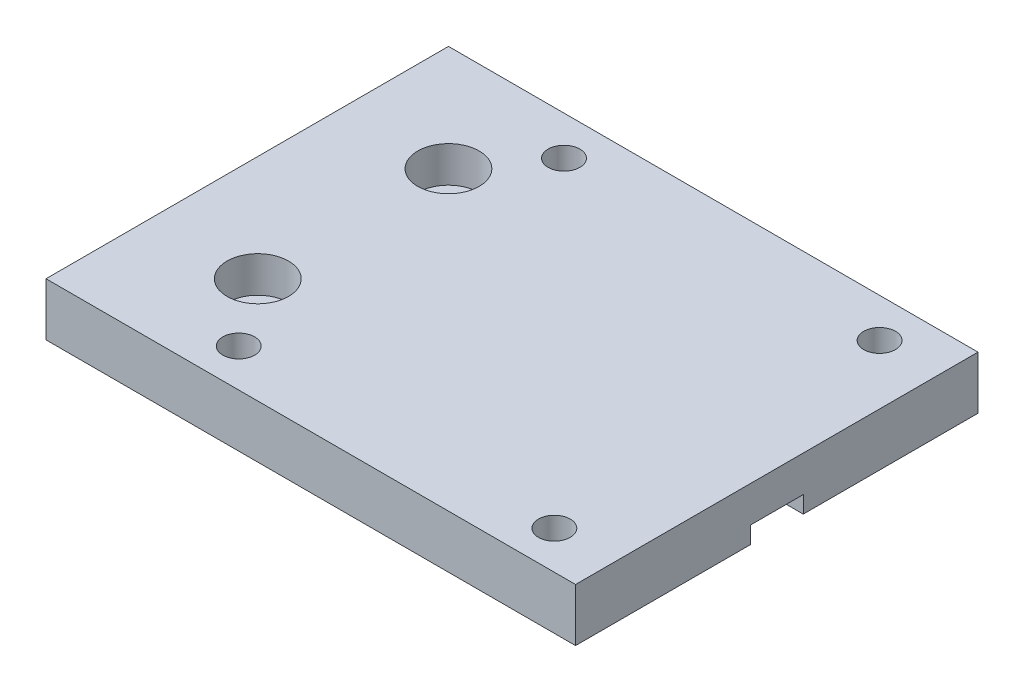
ISO-10303-21;
HEADER;
FILE_DESCRIPTION(('STEP AP214'),'2;1');
FILE_NAME('part.step','',(''),(''),'','','');
FILE_SCHEMA(('AUTOMOTIVE_DESIGN { 1 0 10303 214 1 1 1 1 }'));
ENDSEC;
DATA;
#1=APPLICATION_CONTEXT('core data for automotive mechanical design processes');
#2=APPLICATION_PROTOCOL_DEFINITION('international standard','automotive_design',2000,#1);
#3=PRODUCT_CONTEXT('',#1,'mechanical');
#4=PRODUCT('Part','Part','',(#3));
#5=PRODUCT_RELATED_PRODUCT_CATEGORY('part','',(#4));
#6=PRODUCT_DEFINITION_FORMATION('','',#4);
#7=PRODUCT_DEFINITION_CONTEXT('part definition',#1,'design');
#8=PRODUCT_DEFINITION('design','',#6,#7);
#9=PRODUCT_DEFINITION_SHAPE('','',#8);
#10=(LENGTH_UNIT() NAMED_UNIT(*) SI_UNIT(.MILLI.,.METRE.));
#11=(NAMED_UNIT(*) PLANE_ANGLE_UNIT() SI_UNIT($,.RADIAN.));
#12=(NAMED_UNIT(*) SI_UNIT($,.STERADIAN.) SOLID_ANGLE_UNIT());
#13=UNCERTAINTY_MEASURE_WITH_UNIT(LENGTH_MEASURE(1.E-05),#10,'distance_accuracy_value','');
#14=(GEOMETRIC_REPRESENTATION_CONTEXT(3) GLOBAL_UNCERTAINTY_ASSIGNED_CONTEXT((#13)) GLOBAL_UNIT_ASSIGNED_CONTEXT((#10,
#11,#12)) REPRESENTATION_CONTEXT('',''));
#15=CARTESIAN_POINT('',(0.,0.,0.));
#16=DIRECTION('',(0.,0.,1.));
#17=DIRECTION('',(1.,0.,0.));
#18=AXIS2_PLACEMENT_3D('',#15,#16,#17);
#19=CARTESIAN_POINT('',(31.75,-6.35,-24.13));
#20=DIRECTION('',(1.,0.,0.));
#21=DIRECTION('',(0.,0.,-1.));
#22=AXIS2_PLACEMENT_3D('',#19,#20,#21);
#23=PLANE('',#22);
#24=DIRECTION('',(0.,-1.,0.));
#25=VECTOR('',#24,1.);
#26=CARTESIAN_POINT('',(31.75,-4.318,-3.175));
#27=LINE('',#26,#25);
#28=CARTESIAN_POINT('',(31.75,-4.318,-3.175));
#29=VERTEX_POINT('',#28);
#30=CARTESIAN_POINT('',(31.75,-6.35,-3.175));
#31=VERTEX_POINT('',#30);
#32=EDGE_CURVE('E133',#29,#31,#27,.T.);
#33=ORIENTED_EDGE('',*,*,#32,.T.);
#34=DIRECTION('',(0.,0.,-1.));
#35=VECTOR('',#34,1.);
#36=CARTESIAN_POINT('',(31.75,-6.35,-24.13));
#37=LINE('',#36,#35);
#38=CARTESIAN_POINT('',(31.75,-6.35,-24.13));
#39=VERTEX_POINT('',#38);
#40=EDGE_CURVE('E82',#31,#39,#37,.T.);
#41=ORIENTED_EDGE('',*,*,#40,.T.);
#42=DIRECTION('',(0.,1.,0.));
#43=VECTOR('',#42,1.);
#44=CARTESIAN_POINT('',(31.75,-6.35,-24.13));
#45=LINE('',#44,#43);
#46=CARTESIAN_POINT('',(31.75,0.,-24.13));
#47=VERTEX_POINT('',#46);
#48=EDGE_CURVE('E37',#39,#47,#45,.T.);
#49=ORIENTED_EDGE('',*,*,#48,.T.);
#50=DIRECTION('',(0.,0.,-1.));
#51=VECTOR('',#50,1.);
#52=CARTESIAN_POINT('',(31.75,0.,-24.13));
#53=LINE('',#52,#51);
#54=CARTESIAN_POINT('',(31.75,0.,24.13));
#55=VERTEX_POINT('',#54);
#56=EDGE_CURVE('E140',#55,#47,#53,.T.);
#57=ORIENTED_EDGE('',*,*,#56,.F.);
#58=DIRECTION('',(0.,1.,0.));
#59=VECTOR('',#58,1.);
#60=CARTESIAN_POINT('',(31.75,-6.35,24.13));
#61=LINE('',#60,#59);
#62=CARTESIAN_POINT('',(31.75,-6.35,24.13));
#63=VERTEX_POINT('',#62);
#64=EDGE_CURVE('E11',#63,#55,#61,.T.);
#65=ORIENTED_EDGE('',*,*,#64,.F.);
#66=CARTESIAN_POINT('',(31.75,-6.35,3.17499999999999));
#67=VERTEX_POINT('',#66);
#68=EDGE_CURVE('E122',#63,#67,#37,.T.);
#69=ORIENTED_EDGE('',*,*,#68,.T.);
#70=DIRECTION('',(0.,-1.,0.));
#71=VECTOR('',#70,1.);
#72=CARTESIAN_POINT('',(31.75,-4.318,3.175));
#73=LINE('',#72,#71);
#74=CARTESIAN_POINT('',(31.75,-4.318,3.175));
#75=VERTEX_POINT('',#74);
#76=EDGE_CURVE('E50',#75,#67,#73,.T.);
#77=ORIENTED_EDGE('',*,*,#76,.F.);
#78=DIRECTION('',(0.,0.,1.));
#79=VECTOR('',#78,1.);
#80=CARTESIAN_POINT('',(31.75,-4.318,-3.175));
#81=LINE('',#80,#79);
#82=EDGE_CURVE('E113',#29,#75,#81,.T.);
#83=ORIENTED_EDGE('',*,*,#82,.F.);
#84=EDGE_LOOP('',(#33,#41,#49,#57,#65,#69,#77,#83));
#85=FACE_BOUND('',#84,.T.);
#86=ADVANCED_FACE('F34',(#85),#23,.T.);
#87=CARTESIAN_POINT('',(-31.75,-6.35,24.13));
#88=DIRECTION('',(0.,0.,1.));
#89=DIRECTION('',(1.,0.,0.));
#90=AXIS2_PLACEMENT_3D('',#87,#88,#89);
#91=PLANE('',#90);
#92=DIRECTION('',(1.,0.,0.));
#93=VECTOR('',#92,1.);
#94=CARTESIAN_POINT('',(-31.75,0.,24.13));
#95=LINE('',#94,#93);
#96=CARTESIAN_POINT('',(-31.75,0.,24.13));
#97=VERTEX_POINT('',#96);
#98=EDGE_CURVE('E160',#97,#55,#95,.T.);
#99=ORIENTED_EDGE('',*,*,#98,.F.);
#100=DIRECTION('',(0.,1.,0.));
#101=VECTOR('',#100,1.);
#102=CARTESIAN_POINT('',(-31.75,-6.35,24.13));
#103=LINE('',#102,#101);
#104=CARTESIAN_POINT('',(-31.75,-6.35,24.13));
#105=VERTEX_POINT('',#104);
#106=EDGE_CURVE('E42',#105,#97,#103,.T.);
#107=ORIENTED_EDGE('',*,*,#106,.F.);
#108=DIRECTION('',(1.,0.,0.));
#109=VECTOR('',#108,1.);
#110=CARTESIAN_POINT('',(-31.75,-6.35,24.13));
#111=LINE('',#110,#109);
#112=EDGE_CURVE('E150',#105,#63,#111,.T.);
#113=ORIENTED_EDGE('',*,*,#112,.T.);
#114=ORIENTED_EDGE('',*,*,#64,.T.);
#115=EDGE_LOOP('',(#99,#107,#113,#114));
#116=FACE_BOUND('',#115,.T.);
#117=ADVANCED_FACE('F171',(#116),#91,.T.);
#118=CARTESIAN_POINT('',(-31.75,-6.35,-24.13));
#119=DIRECTION('',(-1.,0.,0.));
#120=DIRECTION('',(0.,0.,1.));
#121=AXIS2_PLACEMENT_3D('',#118,#119,#120);
#122=PLANE('',#121);
#123=DIRECTION('',(0.,0.,1.));
#124=VECTOR('',#123,1.);
#125=CARTESIAN_POINT('',(-31.75,0.,-24.13));
#126=LINE('',#125,#124);
#127=CARTESIAN_POINT('',(-31.75,0.,-24.13));
#128=VERTEX_POINT('',#127);
#129=EDGE_CURVE('E157',#128,#97,#126,.T.);
#130=ORIENTED_EDGE('',*,*,#129,.F.);
#131=DIRECTION('',(0.,1.,0.));
#132=VECTOR('',#131,1.);
#133=CARTESIAN_POINT('',(-31.75,-6.35,-24.13));
#134=LINE('',#133,#132);
#135=CARTESIAN_POINT('',(-31.75,-6.35,-24.13));
#136=VERTEX_POINT('',#135);
#137=EDGE_CURVE('E163',#136,#128,#134,.T.);
#138=ORIENTED_EDGE('',*,*,#137,.F.);
#139=DIRECTION('',(0.,0.,1.));
#140=VECTOR('',#139,1.);
#141=CARTESIAN_POINT('',(-31.75,-6.35,-24.13));
#142=LINE('',#141,#140);
#143=EDGE_CURVE('E147',#136,#105,#142,.T.);
#144=ORIENTED_EDGE('',*,*,#143,.T.);
#145=ORIENTED_EDGE('',*,*,#106,.T.);
#146=EDGE_LOOP('',(#130,#138,#144,#145));
#147=FACE_BOUND('',#146,.T.);
#148=ADVANCED_FACE('F175',(#147),#122,.T.);
#149=CARTESIAN_POINT('',(-31.75,-6.35,-24.13));
#150=DIRECTION('',(0.,0.,-1.));
#151=DIRECTION('',(-1.,0.,0.));
#152=AXIS2_PLACEMENT_3D('',#149,#150,#151);
#153=PLANE('',#152);
#154=DIRECTION('',(-1.,0.,0.));
#155=VECTOR('',#154,1.);
#156=CARTESIAN_POINT('',(-31.75,0.,-24.13));
#157=LINE('',#156,#155);
#158=EDGE_CURVE('E154',#47,#128,#157,.T.);
#159=ORIENTED_EDGE('',*,*,#158,.F.);
#160=ORIENTED_EDGE('',*,*,#48,.F.);
#161=DIRECTION('',(-1.,0.,0.));
#162=VECTOR('',#161,1.);
#163=CARTESIAN_POINT('',(-31.75,-6.35,-24.13));
#164=LINE('',#163,#162);
#165=EDGE_CURVE('E144',#39,#136,#164,.T.);
#166=ORIENTED_EDGE('',*,*,#165,.T.);
#167=ORIENTED_EDGE('',*,*,#137,.T.);
#168=EDGE_LOOP('',(#159,#160,#166,#167));
#169=FACE_BOUND('',#168,.T.);
#170=ADVANCED_FACE('F168',(#169),#153,.T.);
#171=CARTESIAN_POINT('',(0.,-6.35,0.));
#172=DIRECTION('',(0.,1.,0.));
#173=DIRECTION('',(0.,0.,1.));
#174=AXIS2_PLACEMENT_3D('',#171,#172,#173);
#175=PLANE('',#174);
#176=CARTESIAN_POINT('',(-19.05,-6.35,11.43));
#177=DIRECTION('',(0.,1.,0.));
#178=DIRECTION('',(0.,0.,1.));
#179=AXIS2_PLACEMENT_3D('',#176,#177,#178);
#180=CIRCLE('',#179,2.159);
#181=CARTESIAN_POINT('',(-19.05,-6.35,13.589));
#182=VERTEX_POINT('',#181);
#183=EDGE_CURVE('E221',#182,#182,#180,.F.);
#184=ORIENTED_EDGE('',*,*,#183,.F.);
#185=EDGE_LOOP('',(#184));
#186=FACE_BOUND('',#185,.T.);
#187=CARTESIAN_POINT('',(24.638,-6.35,-19.442));
#188=DIRECTION('',(0.,1.,0.));
#189=DIRECTION('',(0.,0.,1.));
#190=AXIS2_PLACEMENT_3D('',#187,#188,#189);
#191=CIRCLE('',#190,1.905);
#192=CARTESIAN_POINT('',(24.638,-6.35,-17.537));
#193=VERTEX_POINT('',#192);
#194=EDGE_CURVE('E211',#193,#193,#191,.T.);
#195=ORIENTED_EDGE('',*,*,#194,.T.);
#196=EDGE_LOOP('',(#195));
#197=FACE_BOUND('',#196,.T.);
#198=CARTESIAN_POINT('',(24.638,-6.35,19.558));
#199=DIRECTION('',(0.,1.,0.));
#200=DIRECTION('',(0.,0.,1.));
#201=AXIS2_PLACEMENT_3D('',#198,#199,#200);
#202=CIRCLE('',#201,1.905);
#203=CARTESIAN_POINT('',(24.638,-6.35,21.463));
#204=VERTEX_POINT('',#203);
#205=EDGE_CURVE('E205',#204,#204,#202,.T.);
#206=ORIENTED_EDGE('',*,*,#205,.T.);
#207=EDGE_LOOP('',(#206));
#208=FACE_BOUND('',#207,.T.);
#209=CARTESIAN_POINT('',(-13.208,-6.35,-19.442));
#210=DIRECTION('',(0.,1.,0.));
#211=DIRECTION('',(0.,0.,1.));
#212=AXIS2_PLACEMENT_3D('',#209,#210,#211);
#213=CIRCLE('',#212,1.905);
#214=CARTESIAN_POINT('',(-13.208,-6.35,-17.537));
#215=VERTEX_POINT('',#214);
#216=EDGE_CURVE('E199',#215,#215,#213,.T.);
#217=ORIENTED_EDGE('',*,*,#216,.T.);
#218=EDGE_LOOP('',(#217));
#219=FACE_BOUND('',#218,.T.);
#220=CARTESIAN_POINT('',(-13.208,-6.35,19.558));
#221=DIRECTION('',(0.,1.,0.));
#222=DIRECTION('',(0.,0.,1.));
#223=AXIS2_PLACEMENT_3D('',#220,#221,#222);
#224=CIRCLE('',#223,1.905);
#225=CARTESIAN_POINT('',(-13.208,-6.35,21.463));
#226=VERTEX_POINT('',#225);
#227=EDGE_CURVE('E183',#226,#226,#224,.T.);
#228=ORIENTED_EDGE('',*,*,#227,.T.);
#229=EDGE_LOOP('',(#228));
#230=FACE_BOUND('',#229,.T.);
#231=CARTESIAN_POINT('',(-19.05,-6.35,-11.43));
#232=DIRECTION('',(0.,1.,0.));
#233=DIRECTION('',(0.,0.,1.));
#234=AXIS2_PLACEMENT_3D('',#231,#232,#233);
#235=CIRCLE('',#234,2.159);
#236=CARTESIAN_POINT('',(-19.05,-6.35,-9.271));
#237=VERTEX_POINT('',#236);
#238=EDGE_CURVE('E132',#237,#237,#235,.T.);
#239=ORIENTED_EDGE('',*,*,#238,.T.);
#240=EDGE_LOOP('',(#239));
#241=FACE_BOUND('',#240,.T.);
#242=ORIENTED_EDGE('',*,*,#40,.F.);
#243=DIRECTION('',(1.,0.,0.));
#244=VECTOR('',#243,1.);
#245=CARTESIAN_POINT('',(-15.24,-6.35,-3.175));
#246=LINE('',#245,#244);
#247=CARTESIAN_POINT('',(-15.24,-6.35,-3.175));
#248=VERTEX_POINT('',#247);
#249=EDGE_CURVE('E120',#248,#31,#246,.T.);
#250=ORIENTED_EDGE('',*,*,#249,.F.);
#251=DIRECTION('',(0.,0.,-1.));
#252=VECTOR('',#251,1.);
#253=CARTESIAN_POINT('',(-15.24,-6.35,-3.175));
#254=LINE('',#253,#252);
#255=CARTESIAN_POINT('',(-15.24,-6.35,3.175));
#256=VERTEX_POINT('',#255);
#257=EDGE_CURVE('E182',#256,#248,#254,.T.);
#258=ORIENTED_EDGE('',*,*,#257,.F.);
#259=DIRECTION('',(-1.,0.,0.));
#260=VECTOR('',#259,1.);
#261=CARTESIAN_POINT('',(-15.24,-6.35,3.175));
#262=LINE('',#261,#260);
#263=EDGE_CURVE('E179',#67,#256,#262,.T.);
#264=ORIENTED_EDGE('',*,*,#263,.F.);
#265=ORIENTED_EDGE('',*,*,#68,.F.);
#266=ORIENTED_EDGE('',*,*,#112,.F.);
#267=ORIENTED_EDGE('',*,*,#143,.F.);
#268=ORIENTED_EDGE('',*,*,#165,.F.);
#269=EDGE_LOOP('',(#242,#250,#258,#264,#265,#266,#267,#268));
#270=FACE_BOUND('',#269,.T.);
#271=ADVANCED_FACE('F177',(#186,#197,#208,#219,#230,#241,#270),#175,.F.);
#272=CARTESIAN_POINT('',(0.,0.,0.));
#273=DIRECTION('',(0.,1.,0.));
#274=DIRECTION('',(0.,0.,1.));
#275=AXIS2_PLACEMENT_3D('',#272,#273,#274);
#276=PLANE('',#275);
#277=CARTESIAN_POINT('',(-19.05,0.,11.43));
#278=DIRECTION('',(0.,-1.,0.));
#279=DIRECTION('',(0.,0.,-1.));
#280=AXIS2_PLACEMENT_3D('',#277,#278,#279);
#281=CIRCLE('',#280,3.683);
#282=CARTESIAN_POINT('',(-19.05,0.,7.747));
#283=VERTEX_POINT('',#282);
#284=EDGE_CURVE('E218',#283,#283,#281,.T.);
#285=ORIENTED_EDGE('',*,*,#284,.T.);
#286=EDGE_LOOP('',(#285));
#287=FACE_BOUND('',#286,.T.);
#288=CARTESIAN_POINT('',(24.638,0.,-19.442));
#289=DIRECTION('',(0.,1.,0.));
#290=DIRECTION('',(0.,0.,1.));
#291=AXIS2_PLACEMENT_3D('',#288,#289,#290);
#292=CIRCLE('',#291,1.905);
#293=CARTESIAN_POINT('',(24.638,0.,-17.537));
#294=VERTEX_POINT('',#293);
#295=EDGE_CURVE('E214',#294,#294,#292,.T.);
#296=ORIENTED_EDGE('',*,*,#295,.F.);
#297=EDGE_LOOP('',(#296));
#298=FACE_BOUND('',#297,.T.);
#299=CARTESIAN_POINT('',(24.638,0.,19.558));
#300=DIRECTION('',(0.,1.,0.));
#301=DIRECTION('',(0.,0.,1.));
#302=AXIS2_PLACEMENT_3D('',#299,#300,#301);
#303=CIRCLE('',#302,1.905);
#304=CARTESIAN_POINT('',(24.638,0.,21.463));
#305=VERTEX_POINT('',#304);
#306=EDGE_CURVE('E208',#305,#305,#303,.T.);
#307=ORIENTED_EDGE('',*,*,#306,.F.);
#308=EDGE_LOOP('',(#307));
#309=FACE_BOUND('',#308,.T.);
#310=CARTESIAN_POINT('',(-13.208,0.,-19.442));
#311=DIRECTION('',(0.,1.,0.));
#312=DIRECTION('',(0.,0.,1.));
#313=AXIS2_PLACEMENT_3D('',#310,#311,#312);
#314=CIRCLE('',#313,1.905);
#315=CARTESIAN_POINT('',(-13.208,0.,-17.537));
#316=VERTEX_POINT('',#315);
#317=EDGE_CURVE('E202',#316,#316,#314,.T.);
#318=ORIENTED_EDGE('',*,*,#317,.F.);
#319=EDGE_LOOP('',(#318));
#320=FACE_BOUND('',#319,.T.);
#321=CARTESIAN_POINT('',(-13.208,0.,19.558));
#322=DIRECTION('',(0.,1.,0.));
#323=DIRECTION('',(0.,0.,1.));
#324=AXIS2_PLACEMENT_3D('',#321,#322,#323);
#325=CIRCLE('',#324,1.905);
#326=CARTESIAN_POINT('',(-13.208,0.,21.463));
#327=VERTEX_POINT('',#326);
#328=EDGE_CURVE('E187',#327,#327,#325,.T.);
#329=ORIENTED_EDGE('',*,*,#328,.F.);
#330=EDGE_LOOP('',(#329));
#331=FACE_BOUND('',#330,.T.);
#332=CARTESIAN_POINT('',(-19.05,0.,-11.43));
#333=DIRECTION('',(0.,1.,0.));
#334=DIRECTION('',(0.,0.,1.));
#335=AXIS2_PLACEMENT_3D('',#332,#333,#334);
#336=CIRCLE('',#335,3.683);
#337=CARTESIAN_POINT('',(-19.05,0.,-7.747));
#338=VERTEX_POINT('',#337);
#339=EDGE_CURVE('E136',#338,#338,#336,.T.);
#340=ORIENTED_EDGE('',*,*,#339,.F.);
#341=EDGE_LOOP('',(#340));
#342=FACE_BOUND('',#341,.T.);
#343=ORIENTED_EDGE('',*,*,#56,.T.);
#344=ORIENTED_EDGE('',*,*,#158,.T.);
#345=ORIENTED_EDGE('',*,*,#129,.T.);
#346=ORIENTED_EDGE('',*,*,#98,.T.);
#347=EDGE_LOOP('',(#343,#344,#345,#346));
#348=FACE_BOUND('',#347,.T.);
#349=ADVANCED_FACE('F170',(#287,#298,#309,#320,#331,#342,#348),#276,.T.);
#350=CARTESIAN_POINT('',(-19.05,-4.318,-11.43));
#351=DIRECTION('',(0.,1.,0.));
#352=DIRECTION('',(0.,0.,1.));
#353=AXIS2_PLACEMENT_3D('',#350,#351,#352);
#354=CYLINDRICAL_SURFACE('',#353,3.683);
#355=CARTESIAN_POINT('',(-19.05,-4.318,-11.43));
#356=DIRECTION('',(0.,1.,0.));
#357=DIRECTION('',(0.,0.,1.));
#358=AXIS2_PLACEMENT_3D('',#355,#356,#357);
#359=CIRCLE('',#358,3.683);
#360=CARTESIAN_POINT('',(-19.05,-4.318,-7.747));
#361=VERTEX_POINT('',#360);
#362=EDGE_CURVE('E137',#361,#361,#359,.T.);
#363=ORIENTED_EDGE('',*,*,#362,.F.);
#364=EDGE_LOOP('',(#363));
#365=FACE_BOUND('',#364,.T.);
#366=ORIENTED_EDGE('',*,*,#339,.T.);
#367=EDGE_LOOP('',(#366));
#368=FACE_BOUND('',#367,.T.);
#369=ADVANCED_FACE('F262',(#365,#368),#354,.F.);
#370=CARTESIAN_POINT('',(-19.05,-4.318,-11.43));
#371=DIRECTION('',(0.,1.,0.));
#372=DIRECTION('',(0.,0.,1.));
#373=AXIS2_PLACEMENT_3D('',#370,#371,#372);
#374=PLANE('',#373);
#375=CARTESIAN_POINT('',(-19.05,-4.318,-11.43));
#376=DIRECTION('',(0.,1.,0.));
#377=DIRECTION('',(0.,0.,1.));
#378=AXIS2_PLACEMENT_3D('',#375,#376,#377);
#379=CIRCLE('',#378,2.159);
#380=CARTESIAN_POINT('',(-19.05,-4.318,-9.271));
#381=VERTEX_POINT('',#380);
#382=EDGE_CURVE('E129',#381,#381,#379,.T.);
#383=ORIENTED_EDGE('',*,*,#382,.F.);
#384=EDGE_LOOP('',(#383));
#385=FACE_BOUND('',#384,.T.);
#386=ORIENTED_EDGE('',*,*,#362,.T.);
#387=EDGE_LOOP('',(#386));
#388=FACE_BOUND('',#387,.T.);
#389=ADVANCED_FACE('F254',(#385,#388),#374,.T.);
#390=CARTESIAN_POINT('',(-19.05,-8.636,-11.43));
#391=DIRECTION('',(0.,1.,0.));
#392=DIRECTION('',(0.,0.,1.));
#393=AXIS2_PLACEMENT_3D('',#390,#391,#392);
#394=CYLINDRICAL_SURFACE('',#393,2.159);
#395=ORIENTED_EDGE('',*,*,#382,.T.);
#396=EDGE_LOOP('',(#395));
#397=FACE_BOUND('',#396,.T.);
#398=ORIENTED_EDGE('',*,*,#238,.F.);
#399=EDGE_LOOP('',(#398));
#400=FACE_BOUND('',#399,.T.);
#401=ADVANCED_FACE('F252',(#397,#400),#394,.F.);
#402=CARTESIAN_POINT('',(-15.24,-4.318,-3.175));
#403=DIRECTION('',(0.,0.,-1.));
#404=DIRECTION('',(-1.,0.,0.));
#405=AXIS2_PLACEMENT_3D('',#402,#403,#404);
#406=PLANE('',#405);
#407=ORIENTED_EDGE('',*,*,#249,.T.);
#408=ORIENTED_EDGE('',*,*,#32,.F.);
#409=DIRECTION('',(1.,0.,0.));
#410=VECTOR('',#409,1.);
#411=CARTESIAN_POINT('',(-15.24,-4.318,-3.175));
#412=LINE('',#411,#410);
#413=CARTESIAN_POINT('',(-15.24,-4.318,-3.175));
#414=VERTEX_POINT('',#413);
#415=EDGE_CURVE('E119',#414,#29,#412,.T.);
#416=ORIENTED_EDGE('',*,*,#415,.F.);
#417=DIRECTION('',(0.,-1.,0.));
#418=VECTOR('',#417,1.);
#419=CARTESIAN_POINT('',(-15.24,-4.318,-3.175));
#420=LINE('',#419,#418);
#421=EDGE_CURVE('E124',#414,#248,#420,.T.);
#422=ORIENTED_EDGE('',*,*,#421,.T.);
#423=EDGE_LOOP('',(#407,#408,#416,#422));
#424=FACE_BOUND('',#423,.T.);
#425=ADVANCED_FACE('F193',(#424),#406,.F.);
#426=CARTESIAN_POINT('',(-15.24,-4.318,-3.175));
#427=DIRECTION('',(-1.,0.,0.));
#428=DIRECTION('',(0.,0.,1.));
#429=AXIS2_PLACEMENT_3D('',#426,#427,#428);
#430=PLANE('',#429);
#431=ORIENTED_EDGE('',*,*,#257,.T.);
#432=ORIENTED_EDGE('',*,*,#421,.F.);
#433=DIRECTION('',(0.,0.,-1.));
#434=VECTOR('',#433,1.);
#435=CARTESIAN_POINT('',(-15.24,-4.318,-3.175));
#436=LINE('',#435,#434);
#437=CARTESIAN_POINT('',(-15.24,-4.318,3.175));
#438=VERTEX_POINT('',#437);
#439=EDGE_CURVE('E112',#438,#414,#436,.T.);
#440=ORIENTED_EDGE('',*,*,#439,.F.);
#441=DIRECTION('',(0.,-1.,0.));
#442=VECTOR('',#441,1.);
#443=CARTESIAN_POINT('',(-15.24,-4.318,3.175));
#444=LINE('',#443,#442);
#445=EDGE_CURVE('E108',#438,#256,#444,.T.);
#446=ORIENTED_EDGE('',*,*,#445,.T.);
#447=EDGE_LOOP('',(#431,#432,#440,#446));
#448=FACE_BOUND('',#447,.T.);
#449=ADVANCED_FACE('F195',(#448),#430,.F.);
#450=CARTESIAN_POINT('',(-15.24,-4.318,3.175));
#451=DIRECTION('',(0.,0.,1.));
#452=DIRECTION('',(1.,0.,0.));
#453=AXIS2_PLACEMENT_3D('',#450,#451,#452);
#454=PLANE('',#453);
#455=ORIENTED_EDGE('',*,*,#263,.T.);
#456=ORIENTED_EDGE('',*,*,#445,.F.);
#457=DIRECTION('',(-1.,0.,0.));
#458=VECTOR('',#457,1.);
#459=CARTESIAN_POINT('',(-15.24,-4.318,3.175));
#460=LINE('',#459,#458);
#461=EDGE_CURVE('E105',#75,#438,#460,.T.);
#462=ORIENTED_EDGE('',*,*,#461,.F.);
#463=ORIENTED_EDGE('',*,*,#76,.T.);
#464=EDGE_LOOP('',(#455,#456,#462,#463));
#465=FACE_BOUND('',#464,.T.);
#466=ADVANCED_FACE('F107',(#465),#454,.F.);
#467=CARTESIAN_POINT('',(0.,-4.318,0.));
#468=DIRECTION('',(0.,1.,0.));
#469=DIRECTION('',(0.,0.,1.));
#470=AXIS2_PLACEMENT_3D('',#467,#468,#469);
#471=PLANE('',#470);
#472=ORIENTED_EDGE('',*,*,#82,.T.);
#473=ORIENTED_EDGE('',*,*,#461,.T.);
#474=ORIENTED_EDGE('',*,*,#439,.T.);
#475=ORIENTED_EDGE('',*,*,#415,.T.);
#476=EDGE_LOOP('',(#472,#473,#474,#475));
#477=FACE_BOUND('',#476,.T.);
#478=ADVANCED_FACE('F117',(#477),#471,.F.);
#479=CARTESIAN_POINT('',(-13.208,-14.732,19.558));
#480=DIRECTION('',(0.,1.,0.));
#481=DIRECTION('',(0.,0.,1.));
#482=AXIS2_PLACEMENT_3D('',#479,#480,#481);
#483=CYLINDRICAL_SURFACE('',#482,1.905);
#484=ORIENTED_EDGE('',*,*,#328,.T.);
#485=EDGE_LOOP('',(#484));
#486=FACE_BOUND('',#485,.T.);
#487=ORIENTED_EDGE('',*,*,#227,.F.);
#488=EDGE_LOOP('',(#487));
#489=FACE_BOUND('',#488,.T.);
#490=ADVANCED_FACE('F343',(#486,#489),#483,.F.);
#491=CARTESIAN_POINT('',(-13.208,-14.732,-19.442));
#492=DIRECTION('',(0.,1.,0.));
#493=DIRECTION('',(0.,0.,1.));
#494=AXIS2_PLACEMENT_3D('',#491,#492,#493);
#495=CYLINDRICAL_SURFACE('',#494,1.905);
#496=ORIENTED_EDGE('',*,*,#317,.T.);
#497=EDGE_LOOP('',(#496));
#498=FACE_BOUND('',#497,.T.);
#499=ORIENTED_EDGE('',*,*,#216,.F.);
#500=EDGE_LOOP('',(#499));
#501=FACE_BOUND('',#500,.T.);
#502=ADVANCED_FACE('F352',(#498,#501),#495,.F.);
#503=CARTESIAN_POINT('',(24.638,-14.732,19.558));
#504=DIRECTION('',(0.,1.,0.));
#505=DIRECTION('',(0.,0.,1.));
#506=AXIS2_PLACEMENT_3D('',#503,#504,#505);
#507=CYLINDRICAL_SURFACE('',#506,1.905);
#508=ORIENTED_EDGE('',*,*,#306,.T.);
#509=EDGE_LOOP('',(#508));
#510=FACE_BOUND('',#509,.T.);
#511=ORIENTED_EDGE('',*,*,#205,.F.);
#512=EDGE_LOOP('',(#511));
#513=FACE_BOUND('',#512,.T.);
#514=ADVANCED_FACE('F362',(#510,#513),#507,.F.);
#515=CARTESIAN_POINT('',(24.638,-14.732,-19.442));
#516=DIRECTION('',(0.,1.,0.));
#517=DIRECTION('',(0.,0.,1.));
#518=AXIS2_PLACEMENT_3D('',#515,#516,#517);
#519=CYLINDRICAL_SURFACE('',#518,1.905);
#520=ORIENTED_EDGE('',*,*,#295,.T.);
#521=EDGE_LOOP('',(#520));
#522=FACE_BOUND('',#521,.T.);
#523=ORIENTED_EDGE('',*,*,#194,.F.);
#524=EDGE_LOOP('',(#523));
#525=FACE_BOUND('',#524,.T.);
#526=ADVANCED_FACE('F371',(#522,#525),#519,.F.);
#527=CARTESIAN_POINT('',(-19.05,-4.318,11.43));
#528=DIRECTION('',(0.,1.,0.));
#529=DIRECTION('',(0.,0.,1.));
#530=AXIS2_PLACEMENT_3D('',#527,#528,#529);
#531=CYLINDRICAL_SURFACE('',#530,3.683);
#532=CARTESIAN_POINT('',(-19.05,-4.318,11.43));
#533=DIRECTION('',(0.,-1.,0.));
#534=DIRECTION('',(0.,0.,-1.));
#535=AXIS2_PLACEMENT_3D('',#532,#533,#534);
#536=CIRCLE('',#535,3.683);
#537=CARTESIAN_POINT('',(-19.05,-4.318,7.747));
#538=VERTEX_POINT('',#537);
#539=EDGE_CURVE('E217',#538,#538,#536,.T.);
#540=ORIENTED_EDGE('',*,*,#539,.T.);
#541=EDGE_LOOP('',(#540));
#542=FACE_BOUND('',#541,.T.);
#543=ORIENTED_EDGE('',*,*,#284,.F.);
#544=EDGE_LOOP('',(#543));
#545=FACE_BOUND('',#544,.T.);
#546=ADVANCED_FACE('F380',(#542,#545),#531,.F.);
#547=CARTESIAN_POINT('',(-19.05,-4.318,11.43));
#548=DIRECTION('',(0.,1.,0.));
#549=DIRECTION('',(0.,0.,-1.));
#550=AXIS2_PLACEMENT_3D('',#547,#548,#549);
#551=PLANE('',#550);
#552=CARTESIAN_POINT('',(-19.05,-4.318,11.43));
#553=DIRECTION('',(0.,-1.,0.));
#554=DIRECTION('',(0.,0.,-1.));
#555=AXIS2_PLACEMENT_3D('',#552,#553,#554);
#556=CIRCLE('',#555,2.159);
#557=CARTESIAN_POINT('',(-19.05,-4.318,9.271));
#558=VERTEX_POINT('',#557);
#559=EDGE_CURVE('E226',#558,#558,#556,.T.);
#560=ORIENTED_EDGE('',*,*,#559,.T.);
#561=EDGE_LOOP('',(#560));
#562=FACE_BOUND('',#561,.T.);
#563=ORIENTED_EDGE('',*,*,#539,.F.);
#564=EDGE_LOOP('',(#563));
#565=FACE_BOUND('',#564,.T.);
#566=ADVANCED_FACE('F230',(#562,#565),#551,.T.);
#567=CARTESIAN_POINT('',(-19.05,-8.636,11.43));
#568=DIRECTION('',(0.,1.,0.));
#569=DIRECTION('',(0.,0.,1.));
#570=AXIS2_PLACEMENT_3D('',#567,#568,#569);
#571=CYLINDRICAL_SURFACE('',#570,2.159);
#572=ORIENTED_EDGE('',*,*,#559,.F.);
#573=EDGE_LOOP('',(#572));
#574=FACE_BOUND('',#573,.T.);
#575=ORIENTED_EDGE('',*,*,#183,.T.);
#576=EDGE_LOOP('',(#575));
#577=FACE_BOUND('',#576,.T.);
#578=ADVANCED_FACE('F233',(#574,#577),#571,.F.);
#579=CLOSED_SHELL('',(#86,#117,#148,#170,#271,#349,#369,#389,#401,#425,#449,#466,#478,#490,#502,
#514,#526,#546,#566,#578));
#580=MANIFOLD_SOLID_BREP('B2',#579);
#581=ADVANCED_BREP_SHAPE_REPRESENTATION('',(#18,#580),#14);
#582=SHAPE_DEFINITION_REPRESENTATION(#9,#581);
ENDSEC;
END-ISO-10303-21;
